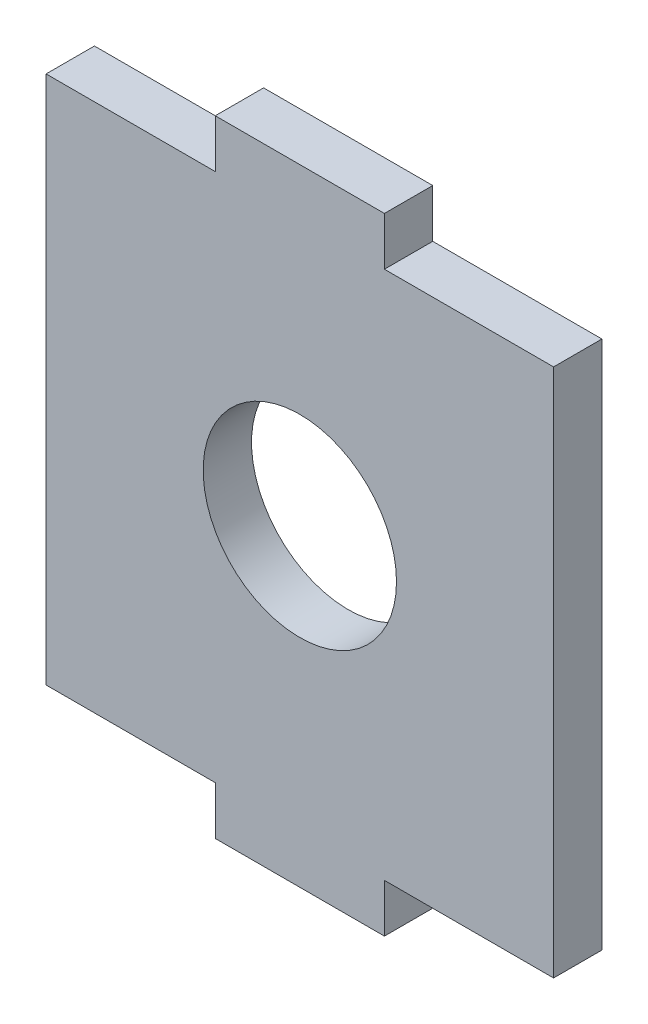
ISO-10303-21;
HEADER;
FILE_DESCRIPTION(('STEP AP214'),'2;1');
FILE_NAME('part.step','',(''),(''),'','','');
FILE_SCHEMA(('AUTOMOTIVE_DESIGN { 1 0 10303 214 1 1 1 1 }'));
ENDSEC;
DATA;
#1=APPLICATION_CONTEXT('core data for automotive mechanical design processes');
#2=APPLICATION_PROTOCOL_DEFINITION('international standard','automotive_design',2000,#1);
#3=PRODUCT_CONTEXT('',#1,'mechanical');
#4=PRODUCT('Part','Part','',(#3));
#5=PRODUCT_RELATED_PRODUCT_CATEGORY('part','',(#4));
#6=PRODUCT_DEFINITION_FORMATION('','',#4);
#7=PRODUCT_DEFINITION_CONTEXT('part definition',#1,'design');
#8=PRODUCT_DEFINITION('design','',#6,#7);
#9=PRODUCT_DEFINITION_SHAPE('','',#8);
#10=(LENGTH_UNIT() NAMED_UNIT(*) SI_UNIT(.MILLI.,.METRE.));
#11=(NAMED_UNIT(*) PLANE_ANGLE_UNIT() SI_UNIT($,.RADIAN.));
#12=(NAMED_UNIT(*) SI_UNIT($,.STERADIAN.) SOLID_ANGLE_UNIT());
#13=UNCERTAINTY_MEASURE_WITH_UNIT(LENGTH_MEASURE(1.E-05),#10,'distance_accuracy_value','');
#14=(GEOMETRIC_REPRESENTATION_CONTEXT(3) GLOBAL_UNCERTAINTY_ASSIGNED_CONTEXT((#13)) GLOBAL_UNIT_ASSIGNED_CONTEXT((#10,
#11,#12)) REPRESENTATION_CONTEXT('',''));
#15=CARTESIAN_POINT('',(0.,0.,0.));
#16=DIRECTION('',(0.,0.,1.));
#17=DIRECTION('',(1.,0.,0.));
#18=AXIS2_PLACEMENT_3D('',#15,#16,#17);
#19=CARTESIAN_POINT('',(0.,0.,2.));
#20=DIRECTION('',(0.,0.,-1.));
#21=DIRECTION('',(-1.,0.,0.));
#22=AXIS2_PLACEMENT_3D('',#19,#20,#21);
#23=PLANE('',#22);
#24=DIRECTION('',(0.,1.,0.));
#25=VECTOR('',#24,1.);
#26=CARTESIAN_POINT('',(10.5,-10.95,2.));
#27=LINE('',#26,#25);
#28=CARTESIAN_POINT('',(10.5,-10.95,2.));
#29=VERTEX_POINT('',#28);
#30=CARTESIAN_POINT('',(10.5,10.95,2.));
#31=VERTEX_POINT('',#30);
#32=EDGE_CURVE('E176',#29,#31,#27,.T.);
#33=ORIENTED_EDGE('',*,*,#32,.T.);
#34=DIRECTION('',(-1.,0.,0.));
#35=VECTOR('',#34,1.);
#36=CARTESIAN_POINT('',(3.5,10.95,2.));
#37=LINE('',#36,#35);
#38=CARTESIAN_POINT('',(3.5,10.95,2.));
#39=VERTEX_POINT('',#38);
#40=EDGE_CURVE('E104',#31,#39,#37,.T.);
#41=ORIENTED_EDGE('',*,*,#40,.T.);
#42=DIRECTION('',(0.,1.,0.));
#43=VECTOR('',#42,1.);
#44=CARTESIAN_POINT('',(3.5,10.95,2.));
#45=LINE('',#44,#43);
#46=CARTESIAN_POINT('',(3.5,12.95,2.));
#47=VERTEX_POINT('',#46);
#48=EDGE_CURVE('E203',#39,#47,#45,.T.);
#49=ORIENTED_EDGE('',*,*,#48,.T.);
#50=DIRECTION('',(-1.,0.,0.));
#51=VECTOR('',#50,1.);
#52=CARTESIAN_POINT('',(-3.5,12.95,2.));
#53=LINE('',#52,#51);
#54=CARTESIAN_POINT('',(-3.5,12.95,2.));
#55=VERTEX_POINT('',#54);
#56=EDGE_CURVE('E222',#47,#55,#53,.T.);
#57=ORIENTED_EDGE('',*,*,#56,.T.);
#58=DIRECTION('',(0.,-1.,0.));
#59=VECTOR('',#58,1.);
#60=CARTESIAN_POINT('',(-3.5,10.95,2.));
#61=LINE('',#60,#59);
#62=CARTESIAN_POINT('',(-3.5,10.95,2.));
#63=VERTEX_POINT('',#62);
#64=EDGE_CURVE('E219',#55,#63,#61,.T.);
#65=ORIENTED_EDGE('',*,*,#64,.T.);
#66=DIRECTION('',(-1.,0.,0.));
#67=VECTOR('',#66,1.);
#68=CARTESIAN_POINT('',(-10.5,10.95,2.));
#69=LINE('',#68,#67);
#70=CARTESIAN_POINT('',(-10.5,10.95,2.));
#71=VERTEX_POINT('',#70);
#72=EDGE_CURVE('E221',#63,#71,#69,.T.);
#73=ORIENTED_EDGE('',*,*,#72,.T.);
#74=DIRECTION('',(0.,-1.,0.));
#75=VECTOR('',#74,1.);
#76=CARTESIAN_POINT('',(-10.5,-10.95,2.));
#77=LINE('',#76,#75);
#78=CARTESIAN_POINT('',(-10.5,-10.95,2.));
#79=VERTEX_POINT('',#78);
#80=EDGE_CURVE('E224',#71,#79,#77,.T.);
#81=ORIENTED_EDGE('',*,*,#80,.T.);
#82=DIRECTION('',(1.,0.,0.));
#83=VECTOR('',#82,1.);
#84=CARTESIAN_POINT('',(-10.5,-10.95,2.));
#85=LINE('',#84,#83);
#86=CARTESIAN_POINT('',(-3.5,-10.95,2.));
#87=VERTEX_POINT('',#86);
#88=EDGE_CURVE('E230',#79,#87,#85,.T.);
#89=ORIENTED_EDGE('',*,*,#88,.T.);
#90=DIRECTION('',(0.,-1.,0.));
#91=VECTOR('',#90,1.);
#92=CARTESIAN_POINT('',(-3.5,-10.95,2.));
#93=LINE('',#92,#91);
#94=CARTESIAN_POINT('',(-3.5,-12.95,2.));
#95=VERTEX_POINT('',#94);
#96=EDGE_CURVE('E135',#87,#95,#93,.T.);
#97=ORIENTED_EDGE('',*,*,#96,.T.);
#98=DIRECTION('',(1.,0.,0.));
#99=VECTOR('',#98,1.);
#100=CARTESIAN_POINT('',(-3.5,-12.95,2.));
#101=LINE('',#100,#99);
#102=CARTESIAN_POINT('',(3.5,-12.95,2.));
#103=VERTEX_POINT('',#102);
#104=EDGE_CURVE('E129',#95,#103,#101,.T.);
#105=ORIENTED_EDGE('',*,*,#104,.T.);
#106=DIRECTION('',(0.,1.,0.));
#107=VECTOR('',#106,1.);
#108=CARTESIAN_POINT('',(3.5,-10.95,2.));
#109=LINE('',#108,#107);
#110=CARTESIAN_POINT('',(3.5,-10.95,2.));
#111=VERTEX_POINT('',#110);
#112=EDGE_CURVE('E133',#103,#111,#109,.T.);
#113=ORIENTED_EDGE('',*,*,#112,.T.);
#114=DIRECTION('',(1.,0.,0.));
#115=VECTOR('',#114,1.);
#116=CARTESIAN_POINT('',(3.5,-10.95,2.));
#117=LINE('',#116,#115);
#118=EDGE_CURVE('E49',#111,#29,#117,.T.);
#119=ORIENTED_EDGE('',*,*,#118,.T.);
#120=EDGE_LOOP('',(#33,#41,#49,#57,#65,#73,#81,#89,#97,#105,#113,#119));
#121=FACE_BOUND('',#120,.T.);
#122=CARTESIAN_POINT('',(0.,0.,2.));
#123=DIRECTION('',(0.,0.,1.));
#124=DIRECTION('',(1.,0.,0.));
#125=AXIS2_PLACEMENT_3D('',#122,#123,#124);
#126=CIRCLE('',#125,4.);
#127=CARTESIAN_POINT('',(4.,0.,2.));
#128=VERTEX_POINT('',#127);
#129=EDGE_CURVE('E157',#128,#128,#126,.T.);
#130=ORIENTED_EDGE('',*,*,#129,.F.);
#131=EDGE_LOOP('',(#130));
#132=FACE_BOUND('',#131,.T.);
#133=ADVANCED_FACE('F32',(#121,#132),#23,.F.);
#134=CARTESIAN_POINT('',(0.,0.,0.));
#135=DIRECTION('',(0.,0.,-1.));
#136=DIRECTION('',(-1.,0.,0.));
#137=AXIS2_PLACEMENT_3D('',#134,#135,#136);
#138=PLANE('',#137);
#139=DIRECTION('',(0.,1.,0.));
#140=VECTOR('',#139,1.);
#141=CARTESIAN_POINT('',(10.5,-10.95,0.));
#142=LINE('',#141,#140);
#143=CARTESIAN_POINT('',(10.5,-10.95,0.));
#144=VERTEX_POINT('',#143);
#145=CARTESIAN_POINT('',(10.5,10.95,0.));
#146=VERTEX_POINT('',#145);
#147=EDGE_CURVE('E153',#144,#146,#142,.T.);
#148=ORIENTED_EDGE('',*,*,#147,.F.);
#149=DIRECTION('',(1.,0.,0.));
#150=VECTOR('',#149,1.);
#151=CARTESIAN_POINT('',(3.5,-10.95,0.));
#152=LINE('',#151,#150);
#153=CARTESIAN_POINT('',(3.5,-10.95,0.));
#154=VERTEX_POINT('',#153);
#155=EDGE_CURVE('E96',#154,#144,#152,.T.);
#156=ORIENTED_EDGE('',*,*,#155,.F.);
#157=DIRECTION('',(0.,1.,0.));
#158=VECTOR('',#157,1.);
#159=CARTESIAN_POINT('',(3.5,-10.95,0.));
#160=LINE('',#159,#158);
#161=CARTESIAN_POINT('',(3.5,-12.95,0.));
#162=VERTEX_POINT('',#161);
#163=EDGE_CURVE('E90',#162,#154,#160,.T.);
#164=ORIENTED_EDGE('',*,*,#163,.F.);
#165=DIRECTION('',(1.,0.,0.));
#166=VECTOR('',#165,1.);
#167=CARTESIAN_POINT('',(-3.5,-12.95,0.));
#168=LINE('',#167,#166);
#169=CARTESIAN_POINT('',(-3.5,-12.95,0.));
#170=VERTEX_POINT('',#169);
#171=EDGE_CURVE('E143',#170,#162,#168,.T.);
#172=ORIENTED_EDGE('',*,*,#171,.F.);
#173=DIRECTION('',(0.,-1.,0.));
#174=VECTOR('',#173,1.);
#175=CARTESIAN_POINT('',(-3.5,-10.95,0.));
#176=LINE('',#175,#174);
#177=CARTESIAN_POINT('',(-3.5,-10.95,0.));
#178=VERTEX_POINT('',#177);
#179=EDGE_CURVE('E171',#178,#170,#176,.T.);
#180=ORIENTED_EDGE('',*,*,#179,.F.);
#181=DIRECTION('',(1.,0.,0.));
#182=VECTOR('',#181,1.);
#183=CARTESIAN_POINT('',(-10.5,-10.95,0.));
#184=LINE('',#183,#182);
#185=CARTESIAN_POINT('',(-10.5,-10.95,0.));
#186=VERTEX_POINT('',#185);
#187=EDGE_CURVE('E169',#186,#178,#184,.T.);
#188=ORIENTED_EDGE('',*,*,#187,.F.);
#189=DIRECTION('',(0.,-1.,0.));
#190=VECTOR('',#189,1.);
#191=CARTESIAN_POINT('',(-10.5,-10.95,0.));
#192=LINE('',#191,#190);
#193=CARTESIAN_POINT('',(-10.5,10.95,0.));
#194=VERTEX_POINT('',#193);
#195=EDGE_CURVE('E167',#194,#186,#192,.T.);
#196=ORIENTED_EDGE('',*,*,#195,.F.);
#197=DIRECTION('',(-1.,0.,0.));
#198=VECTOR('',#197,1.);
#199=CARTESIAN_POINT('',(-10.5,10.95,0.));
#200=LINE('',#199,#198);
#201=CARTESIAN_POINT('',(-3.5,10.95,0.));
#202=VERTEX_POINT('',#201);
#203=EDGE_CURVE('E165',#202,#194,#200,.T.);
#204=ORIENTED_EDGE('',*,*,#203,.F.);
#205=DIRECTION('',(0.,-1.,0.));
#206=VECTOR('',#205,1.);
#207=CARTESIAN_POINT('',(-3.5,10.95,0.));
#208=LINE('',#207,#206);
#209=CARTESIAN_POINT('',(-3.5,12.95,0.));
#210=VERTEX_POINT('',#209);
#211=EDGE_CURVE('E163',#210,#202,#208,.T.);
#212=ORIENTED_EDGE('',*,*,#211,.F.);
#213=DIRECTION('',(-1.,0.,0.));
#214=VECTOR('',#213,1.);
#215=CARTESIAN_POINT('',(-3.5,12.95,0.));
#216=LINE('',#215,#214);
#217=CARTESIAN_POINT('',(3.5,12.95,0.));
#218=VERTEX_POINT('',#217);
#219=EDGE_CURVE('E161',#218,#210,#216,.T.);
#220=ORIENTED_EDGE('',*,*,#219,.F.);
#221=DIRECTION('',(0.,1.,0.));
#222=VECTOR('',#221,1.);
#223=CARTESIAN_POINT('',(3.5,10.95,0.));
#224=LINE('',#223,#222);
#225=CARTESIAN_POINT('',(3.5,10.95,0.));
#226=VERTEX_POINT('',#225);
#227=EDGE_CURVE('E159',#226,#218,#224,.T.);
#228=ORIENTED_EDGE('',*,*,#227,.F.);
#229=DIRECTION('',(-1.,0.,0.));
#230=VECTOR('',#229,1.);
#231=CARTESIAN_POINT('',(3.5,10.95,0.));
#232=LINE('',#231,#230);
#233=EDGE_CURVE('E156',#146,#226,#232,.T.);
#234=ORIENTED_EDGE('',*,*,#233,.F.);
#235=EDGE_LOOP('',(#148,#156,#164,#172,#180,#188,#196,#204,#212,#220,#228,#234));
#236=FACE_BOUND('',#235,.T.);
#237=CARTESIAN_POINT('',(0.,0.,0.));
#238=DIRECTION('',(0.,0.,1.));
#239=DIRECTION('',(1.,0.,0.));
#240=AXIS2_PLACEMENT_3D('',#237,#238,#239);
#241=CIRCLE('',#240,4.);
#242=CARTESIAN_POINT('',(4.,0.,0.));
#243=VERTEX_POINT('',#242);
#244=EDGE_CURVE('E377',#243,#243,#241,.T.);
#245=ORIENTED_EDGE('',*,*,#244,.T.);
#246=EDGE_LOOP('',(#245));
#247=FACE_BOUND('',#246,.T.);
#248=ADVANCED_FACE('F207',(#236,#247),#138,.T.);
#249=CARTESIAN_POINT('',(10.5,-10.95,2.));
#250=DIRECTION('',(-1.,0.,0.));
#251=DIRECTION('',(0.,0.,1.));
#252=AXIS2_PLACEMENT_3D('',#249,#250,#251);
#253=PLANE('',#252);
#254=ORIENTED_EDGE('',*,*,#147,.T.);
#255=DIRECTION('',(0.,0.,-1.));
#256=VECTOR('',#255,1.);
#257=CARTESIAN_POINT('',(10.5,10.95,2.));
#258=LINE('',#257,#256);
#259=EDGE_CURVE('E11',#31,#146,#258,.T.);
#260=ORIENTED_EDGE('',*,*,#259,.F.);
#261=ORIENTED_EDGE('',*,*,#32,.F.);
#262=DIRECTION('',(0.,0.,-1.));
#263=VECTOR('',#262,1.);
#264=CARTESIAN_POINT('',(10.5,-10.95,2.));
#265=LINE('',#264,#263);
#266=EDGE_CURVE('E149',#29,#144,#265,.T.);
#267=ORIENTED_EDGE('',*,*,#266,.T.);
#268=EDGE_LOOP('',(#254,#260,#261,#267));
#269=FACE_BOUND('',#268,.T.);
#270=ADVANCED_FACE('F34',(#269),#253,.F.);
#271=CARTESIAN_POINT('',(3.5,10.95,2.));
#272=DIRECTION('',(0.,-1.,0.));
#273=DIRECTION('',(0.,0.,-1.));
#274=AXIS2_PLACEMENT_3D('',#271,#272,#273);
#275=PLANE('',#274);
#276=ORIENTED_EDGE('',*,*,#233,.T.);
#277=DIRECTION('',(0.,0.,-1.));
#278=VECTOR('',#277,1.);
#279=CARTESIAN_POINT('',(3.5,10.95,2.));
#280=LINE('',#279,#278);
#281=EDGE_CURVE('E41',#39,#226,#280,.T.);
#282=ORIENTED_EDGE('',*,*,#281,.F.);
#283=ORIENTED_EDGE('',*,*,#40,.F.);
#284=ORIENTED_EDGE('',*,*,#259,.T.);
#285=EDGE_LOOP('',(#276,#282,#283,#284));
#286=FACE_BOUND('',#285,.T.);
#287=ADVANCED_FACE('F264',(#286),#275,.F.);
#288=CARTESIAN_POINT('',(3.5,10.95,2.));
#289=DIRECTION('',(-1.,0.,0.));
#290=DIRECTION('',(0.,0.,1.));
#291=AXIS2_PLACEMENT_3D('',#288,#289,#290);
#292=PLANE('',#291);
#293=ORIENTED_EDGE('',*,*,#227,.T.);
#294=DIRECTION('',(0.,0.,-1.));
#295=VECTOR('',#294,1.);
#296=CARTESIAN_POINT('',(3.5,12.95,2.));
#297=LINE('',#296,#295);
#298=EDGE_CURVE('E195',#47,#218,#297,.T.);
#299=ORIENTED_EDGE('',*,*,#298,.F.);
#300=ORIENTED_EDGE('',*,*,#48,.F.);
#301=ORIENTED_EDGE('',*,*,#281,.T.);
#302=EDGE_LOOP('',(#293,#299,#300,#301));
#303=FACE_BOUND('',#302,.T.);
#304=ADVANCED_FACE('F201',(#303),#292,.F.);
#305=CARTESIAN_POINT('',(-3.5,12.95,2.));
#306=DIRECTION('',(0.,-1.,0.));
#307=DIRECTION('',(0.,0.,-1.));
#308=AXIS2_PLACEMENT_3D('',#305,#306,#307);
#309=PLANE('',#308);
#310=ORIENTED_EDGE('',*,*,#219,.T.);
#311=DIRECTION('',(0.,0.,-1.));
#312=VECTOR('',#311,1.);
#313=CARTESIAN_POINT('',(-3.5,12.95,2.));
#314=LINE('',#313,#312);
#315=EDGE_CURVE('E192',#55,#210,#314,.T.);
#316=ORIENTED_EDGE('',*,*,#315,.F.);
#317=ORIENTED_EDGE('',*,*,#56,.F.);
#318=ORIENTED_EDGE('',*,*,#298,.T.);
#319=EDGE_LOOP('',(#310,#316,#317,#318));
#320=FACE_BOUND('',#319,.T.);
#321=ADVANCED_FACE('F213',(#320),#309,.F.);
#322=CARTESIAN_POINT('',(-3.5,10.95,2.));
#323=DIRECTION('',(1.,0.,0.));
#324=DIRECTION('',(0.,0.,-1.));
#325=AXIS2_PLACEMENT_3D('',#322,#323,#324);
#326=PLANE('',#325);
#327=ORIENTED_EDGE('',*,*,#211,.T.);
#328=DIRECTION('',(0.,0.,-1.));
#329=VECTOR('',#328,1.);
#330=CARTESIAN_POINT('',(-3.5,10.95,2.));
#331=LINE('',#330,#329);
#332=EDGE_CURVE('E189',#63,#202,#331,.T.);
#333=ORIENTED_EDGE('',*,*,#332,.F.);
#334=ORIENTED_EDGE('',*,*,#64,.F.);
#335=ORIENTED_EDGE('',*,*,#315,.T.);
#336=EDGE_LOOP('',(#327,#333,#334,#335));
#337=FACE_BOUND('',#336,.T.);
#338=ADVANCED_FACE('F217',(#337),#326,.F.);
#339=CARTESIAN_POINT('',(-10.5,10.95,2.));
#340=DIRECTION('',(0.,-1.,0.));
#341=DIRECTION('',(0.,0.,-1.));
#342=AXIS2_PLACEMENT_3D('',#339,#340,#341);
#343=PLANE('',#342);
#344=ORIENTED_EDGE('',*,*,#203,.T.);
#345=DIRECTION('',(0.,0.,-1.));
#346=VECTOR('',#345,1.);
#347=CARTESIAN_POINT('',(-10.5,10.95,2.));
#348=LINE('',#347,#346);
#349=EDGE_CURVE('E186',#71,#194,#348,.T.);
#350=ORIENTED_EDGE('',*,*,#349,.F.);
#351=ORIENTED_EDGE('',*,*,#72,.F.);
#352=ORIENTED_EDGE('',*,*,#332,.T.);
#353=EDGE_LOOP('',(#344,#350,#351,#352));
#354=FACE_BOUND('',#353,.T.);
#355=ADVANCED_FACE('F277',(#354),#343,.F.);
#356=CARTESIAN_POINT('',(-10.5,-10.95,2.));
#357=DIRECTION('',(1.,0.,0.));
#358=DIRECTION('',(0.,0.,-1.));
#359=AXIS2_PLACEMENT_3D('',#356,#357,#358);
#360=PLANE('',#359);
#361=ORIENTED_EDGE('',*,*,#195,.T.);
#362=DIRECTION('',(0.,0.,-1.));
#363=VECTOR('',#362,1.);
#364=CARTESIAN_POINT('',(-10.5,-10.95,2.));
#365=LINE('',#364,#363);
#366=EDGE_CURVE('E183',#79,#186,#365,.T.);
#367=ORIENTED_EDGE('',*,*,#366,.F.);
#368=ORIENTED_EDGE('',*,*,#80,.F.);
#369=ORIENTED_EDGE('',*,*,#349,.T.);
#370=EDGE_LOOP('',(#361,#367,#368,#369));
#371=FACE_BOUND('',#370,.T.);
#372=ADVANCED_FACE('F280',(#371),#360,.F.);
#373=CARTESIAN_POINT('',(-10.5,-10.95,2.));
#374=DIRECTION('',(0.,1.,0.));
#375=DIRECTION('',(0.,0.,1.));
#376=AXIS2_PLACEMENT_3D('',#373,#374,#375);
#377=PLANE('',#376);
#378=ORIENTED_EDGE('',*,*,#187,.T.);
#379=DIRECTION('',(0.,0.,-1.));
#380=VECTOR('',#379,1.);
#381=CARTESIAN_POINT('',(-3.5,-10.95,2.));
#382=LINE('',#381,#380);
#383=EDGE_CURVE('E180',#87,#178,#382,.T.);
#384=ORIENTED_EDGE('',*,*,#383,.F.);
#385=ORIENTED_EDGE('',*,*,#88,.F.);
#386=ORIENTED_EDGE('',*,*,#366,.T.);
#387=EDGE_LOOP('',(#378,#384,#385,#386));
#388=FACE_BOUND('',#387,.T.);
#389=ADVANCED_FACE('F236',(#388),#377,.F.);
#390=CARTESIAN_POINT('',(-3.5,-10.95,2.));
#391=DIRECTION('',(1.,0.,0.));
#392=DIRECTION('',(0.,1.,0.));
#393=AXIS2_PLACEMENT_3D('',#390,#391,#392);
#394=PLANE('',#393);
#395=ORIENTED_EDGE('',*,*,#179,.T.);
#396=DIRECTION('',(0.,0.,-1.));
#397=VECTOR('',#396,1.);
#398=CARTESIAN_POINT('',(-3.5,-12.95,2.));
#399=LINE('',#398,#397);
#400=EDGE_CURVE('E144',#95,#170,#399,.T.);
#401=ORIENTED_EDGE('',*,*,#400,.F.);
#402=ORIENTED_EDGE('',*,*,#96,.F.);
#403=ORIENTED_EDGE('',*,*,#383,.T.);
#404=EDGE_LOOP('',(#395,#401,#402,#403));
#405=FACE_BOUND('',#404,.T.);
#406=ADVANCED_FACE('F240',(#405),#394,.F.);
#407=CARTESIAN_POINT('',(-3.5,-12.95,2.));
#408=DIRECTION('',(0.,1.,0.));
#409=DIRECTION('',(0.,0.,1.));
#410=AXIS2_PLACEMENT_3D('',#407,#408,#409);
#411=PLANE('',#410);
#412=ORIENTED_EDGE('',*,*,#171,.T.);
#413=DIRECTION('',(0.,0.,-1.));
#414=VECTOR('',#413,1.);
#415=CARTESIAN_POINT('',(3.5,-12.95,2.));
#416=LINE('',#415,#414);
#417=EDGE_CURVE('E140',#103,#162,#416,.T.);
#418=ORIENTED_EDGE('',*,*,#417,.F.);
#419=ORIENTED_EDGE('',*,*,#104,.F.);
#420=ORIENTED_EDGE('',*,*,#400,.T.);
#421=EDGE_LOOP('',(#412,#418,#419,#420));
#422=FACE_BOUND('',#421,.T.);
#423=ADVANCED_FACE('F141',(#422),#411,.F.);
#424=CARTESIAN_POINT('',(3.5,-10.95,2.));
#425=DIRECTION('',(-1.,0.,0.));
#426=DIRECTION('',(0.,-1.,0.));
#427=AXIS2_PLACEMENT_3D('',#424,#425,#426);
#428=PLANE('',#427);
#429=ORIENTED_EDGE('',*,*,#163,.T.);
#430=DIRECTION('',(0.,0.,-1.));
#431=VECTOR('',#430,1.);
#432=CARTESIAN_POINT('',(3.5,-10.95,2.));
#433=LINE('',#432,#431);
#434=EDGE_CURVE('E145',#111,#154,#433,.T.);
#435=ORIENTED_EDGE('',*,*,#434,.F.);
#436=ORIENTED_EDGE('',*,*,#112,.F.);
#437=ORIENTED_EDGE('',*,*,#417,.T.);
#438=EDGE_LOOP('',(#429,#435,#436,#437));
#439=FACE_BOUND('',#438,.T.);
#440=ADVANCED_FACE('F147',(#439),#428,.F.);
#441=CARTESIAN_POINT('',(3.5,-10.95,2.));
#442=DIRECTION('',(0.,1.,0.));
#443=DIRECTION('',(0.,0.,1.));
#444=AXIS2_PLACEMENT_3D('',#441,#442,#443);
#445=PLANE('',#444);
#446=ORIENTED_EDGE('',*,*,#155,.T.);
#447=ORIENTED_EDGE('',*,*,#266,.F.);
#448=ORIENTED_EDGE('',*,*,#118,.F.);
#449=ORIENTED_EDGE('',*,*,#434,.T.);
#450=EDGE_LOOP('',(#446,#447,#448,#449));
#451=FACE_BOUND('',#450,.T.);
#452=ADVANCED_FACE('F244',(#451),#445,.F.);
#453=CARTESIAN_POINT('',(0.,0.,2.));
#454=DIRECTION('',(0.,0.,-1.));
#455=DIRECTION('',(-1.,0.,0.));
#456=AXIS2_PLACEMENT_3D('',#453,#454,#455);
#457=CYLINDRICAL_SURFACE('',#456,4.);
#458=ORIENTED_EDGE('',*,*,#129,.T.);
#459=EDGE_LOOP('',(#458));
#460=FACE_BOUND('',#459,.T.);
#461=ORIENTED_EDGE('',*,*,#244,.F.);
#462=EDGE_LOOP('',(#461));
#463=FACE_BOUND('',#462,.T.);
#464=ADVANCED_FACE('F246',(#460,#463),#457,.F.);
#465=CLOSED_SHELL('',(#133,#248,#270,#287,#304,#321,#338,#355,#372,#389,#406,#423,#440,#452,#464));
#466=MANIFOLD_SOLID_BREP('B2',#465);
#467=ADVANCED_BREP_SHAPE_REPRESENTATION('',(#18,#466),#14);
#468=SHAPE_DEFINITION_REPRESENTATION(#9,#467);
ENDSEC;
END-ISO-10303-21;
